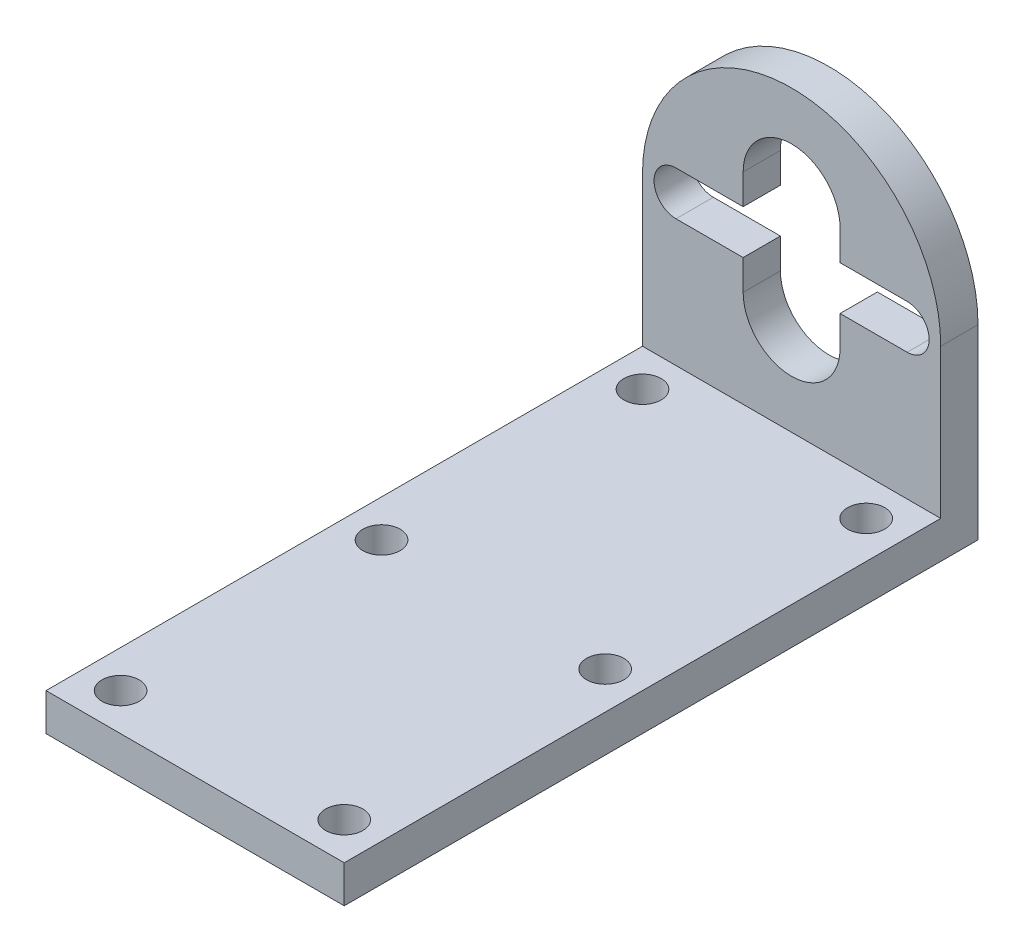
ISO-10303-21;
HEADER;
FILE_DESCRIPTION(('STEP AP214'),'2;1');
FILE_NAME('part.step','',(''),(''),'','','');
FILE_SCHEMA(('AUTOMOTIVE_DESIGN { 1 0 10303 214 1 1 1 1 }'));
ENDSEC;
DATA;
#1=APPLICATION_CONTEXT('core data for automotive mechanical design processes');
#2=APPLICATION_PROTOCOL_DEFINITION('international standard','automotive_design',2000,#1);
#3=PRODUCT_CONTEXT('',#1,'mechanical');
#4=PRODUCT('Part','Part','',(#3));
#5=PRODUCT_RELATED_PRODUCT_CATEGORY('part','',(#4));
#6=PRODUCT_DEFINITION_FORMATION('','',#4);
#7=PRODUCT_DEFINITION_CONTEXT('part definition',#1,'design');
#8=PRODUCT_DEFINITION('design','',#6,#7);
#9=PRODUCT_DEFINITION_SHAPE('','',#8);
#10=(LENGTH_UNIT() NAMED_UNIT(*) SI_UNIT(.MILLI.,.METRE.));
#11=(NAMED_UNIT(*) PLANE_ANGLE_UNIT() SI_UNIT($,.RADIAN.));
#12=(NAMED_UNIT(*) SI_UNIT($,.STERADIAN.) SOLID_ANGLE_UNIT());
#13=UNCERTAINTY_MEASURE_WITH_UNIT(LENGTH_MEASURE(1.E-05),#10,'distance_accuracy_value','');
#14=(GEOMETRIC_REPRESENTATION_CONTEXT(3) GLOBAL_UNCERTAINTY_ASSIGNED_CONTEXT((#13)) GLOBAL_UNIT_ASSIGNED_CONTEXT((#10,
#11,#12)) REPRESENTATION_CONTEXT('',''));
#15=CARTESIAN_POINT('',(0.,0.,0.));
#16=DIRECTION('',(0.,0.,1.));
#17=DIRECTION('',(1.,0.,0.));
#18=AXIS2_PLACEMENT_3D('',#15,#16,#17);
#19=CARTESIAN_POINT('',(-15.5,-2.95,5.));
#20=DIRECTION('',(0.,1.,0.));
#21=DIRECTION('',(-1.,0.,0.));
#22=AXIS2_PLACEMENT_3D('',#19,#20,#21);
#23=PLANE('',#22);
#24=DIRECTION('',(0.,0.,-1.));
#25=VECTOR('',#24,1.);
#26=CARTESIAN_POINT('',(6.5,-2.95,5.));
#27=LINE('',#26,#25);
#28=CARTESIAN_POINT('',(6.5,-2.95,5.));
#29=VERTEX_POINT('',#28);
#30=CARTESIAN_POINT('',(6.5,-2.95,0.));
#31=VERTEX_POINT('',#30);
#32=EDGE_CURVE('E209',#29,#31,#27,.T.);
#33=ORIENTED_EDGE('',*,*,#32,.F.);
#34=DIRECTION('',(1.,0.,0.));
#35=VECTOR('',#34,1.);
#36=CARTESIAN_POINT('',(-15.5,-2.95,5.));
#37=LINE('',#36,#35);
#38=CARTESIAN_POINT('',(15.5,-2.94999999999999,5.));
#39=VERTEX_POINT('',#38);
#40=EDGE_CURVE('E271',#29,#39,#37,.T.);
#41=ORIENTED_EDGE('',*,*,#40,.T.);
#42=DIRECTION('',(0.,0.,-1.));
#43=VECTOR('',#42,1.);
#44=CARTESIAN_POINT('',(15.5,-2.94999999999999,5.));
#45=LINE('',#44,#43);
#46=CARTESIAN_POINT('',(15.5,-2.94999999999999,0.));
#47=VERTEX_POINT('',#46);
#48=EDGE_CURVE('E299',#39,#47,#45,.T.);
#49=ORIENTED_EDGE('',*,*,#48,.T.);
#50=DIRECTION('',(1.,0.,0.));
#51=VECTOR('',#50,1.);
#52=CARTESIAN_POINT('',(-15.5,-2.95,0.));
#53=LINE('',#52,#51);
#54=EDGE_CURVE('E285',#31,#47,#53,.T.);
#55=ORIENTED_EDGE('',*,*,#54,.F.);
#56=EDGE_LOOP('',(#33,#41,#49,#55));
#57=FACE_BOUND('',#56,.T.);
#58=ADVANCED_FACE('F43',(#57),#23,.T.);
#59=CARTESIAN_POINT('',(-15.5,2.95,5.));
#60=DIRECTION('',(0.,-1.,0.));
#61=DIRECTION('',(1.,0.,0.));
#62=AXIS2_PLACEMENT_3D('',#59,#60,#61);
#63=PLANE('',#62);
#64=DIRECTION('',(0.,0.,1.));
#65=VECTOR('',#64,1.);
#66=CARTESIAN_POINT('',(6.5,2.95,5.));
#67=LINE('',#66,#65);
#68=CARTESIAN_POINT('',(6.5,2.95,0.));
#69=VERTEX_POINT('',#68);
#70=CARTESIAN_POINT('',(6.5,2.95,5.));
#71=VERTEX_POINT('',#70);
#72=EDGE_CURVE('E335',#69,#71,#67,.T.);
#73=ORIENTED_EDGE('',*,*,#72,.F.);
#74=DIRECTION('',(-1.,0.,0.));
#75=VECTOR('',#74,1.);
#76=CARTESIAN_POINT('',(-15.5,2.95,0.));
#77=LINE('',#76,#75);
#78=CARTESIAN_POINT('',(15.5,2.95000000000001,0.));
#79=VERTEX_POINT('',#78);
#80=EDGE_CURVE('E272',#79,#69,#77,.T.);
#81=ORIENTED_EDGE('',*,*,#80,.F.);
#82=DIRECTION('',(0.,0.,-1.));
#83=VECTOR('',#82,1.);
#84=CARTESIAN_POINT('',(15.5,2.95000000000001,5.));
#85=LINE('',#84,#83);
#86=CARTESIAN_POINT('',(15.5,2.95000000000001,5.));
#87=VERTEX_POINT('',#86);
#88=EDGE_CURVE('E297',#87,#79,#85,.T.);
#89=ORIENTED_EDGE('',*,*,#88,.F.);
#90=DIRECTION('',(-1.,0.,0.));
#91=VECTOR('',#90,1.);
#92=CARTESIAN_POINT('',(-15.5,2.95,5.));
#93=LINE('',#92,#91);
#94=EDGE_CURVE('E279',#87,#71,#93,.T.);
#95=ORIENTED_EDGE('',*,*,#94,.T.);
#96=EDGE_LOOP('',(#73,#81,#89,#95));
#97=FACE_BOUND('',#96,.T.);
#98=ADVANCED_FACE('F363',(#97),#63,.T.);
#99=CARTESIAN_POINT('',(0.,0.,5.));
#100=DIRECTION('',(0.,0.,1.));
#101=DIRECTION('',(1.,0.,0.));
#102=AXIS2_PLACEMENT_3D('',#99,#100,#101);
#103=PLANE('',#102);
#104=DIRECTION('',(0.,1.,0.));
#105=VECTOR('',#104,1.);
#106=CARTESIAN_POINT('',(6.5,7.,5.));
#107=LINE('',#106,#105);
#108=CARTESIAN_POINT('',(6.5,7.,5.));
#109=VERTEX_POINT('',#108);
#110=EDGE_CURVE('E194',#71,#109,#107,.T.);
#111=ORIENTED_EDGE('',*,*,#110,.F.);
#112=ORIENTED_EDGE('',*,*,#94,.F.);
#113=CARTESIAN_POINT('',(15.5,0.,5.));
#114=DIRECTION('',(0.,0.,1.));
#115=DIRECTION('',(1.,0.,0.));
#116=AXIS2_PLACEMENT_3D('',#113,#114,#115);
#117=CIRCLE('',#116,2.95);
#118=EDGE_CURVE('E276',#39,#87,#117,.T.);
#119=ORIENTED_EDGE('',*,*,#118,.F.);
#120=ORIENTED_EDGE('',*,*,#40,.F.);
#121=CARTESIAN_POINT('',(6.5,-7.,5.));
#122=VERTEX_POINT('',#121);
#123=EDGE_CURVE('E174',#122,#29,#107,.T.);
#124=ORIENTED_EDGE('',*,*,#123,.F.);
#125=CARTESIAN_POINT('',(0.,-7.,5.));
#126=DIRECTION('',(0.,0.,1.));
#127=DIRECTION('',(1.,0.,0.));
#128=AXIS2_PLACEMENT_3D('',#125,#126,#127);
#129=CIRCLE('',#128,6.5);
#130=CARTESIAN_POINT('',(-6.5,-7.,5.));
#131=VERTEX_POINT('',#130);
#132=EDGE_CURVE('E191',#131,#122,#129,.T.);
#133=ORIENTED_EDGE('',*,*,#132,.F.);
#134=DIRECTION('',(0.,-1.,0.));
#135=VECTOR('',#134,1.);
#136=CARTESIAN_POINT('',(-6.5,7.,5.));
#137=LINE('',#136,#135);
#138=CARTESIAN_POINT('',(-6.5,-2.94999999999999,5.));
#139=VERTEX_POINT('',#138);
#140=EDGE_CURVE('E184',#139,#131,#137,.T.);
#141=ORIENTED_EDGE('',*,*,#140,.F.);
#142=CARTESIAN_POINT('',(-15.5,-2.95,5.));
#143=VERTEX_POINT('',#142);
#144=EDGE_CURVE('E273',#143,#139,#37,.T.);
#145=ORIENTED_EDGE('',*,*,#144,.F.);
#146=CARTESIAN_POINT('',(-15.5,0.,5.));
#147=DIRECTION('',(0.,0.,1.));
#148=DIRECTION('',(1.,0.,0.));
#149=AXIS2_PLACEMENT_3D('',#146,#147,#148);
#150=CIRCLE('',#149,2.95);
#151=CARTESIAN_POINT('',(-15.5,2.95,5.));
#152=VERTEX_POINT('',#151);
#153=EDGE_CURVE('E269',#152,#143,#150,.T.);
#154=ORIENTED_EDGE('',*,*,#153,.F.);
#155=CARTESIAN_POINT('',(-6.5,2.95,5.));
#156=VERTEX_POINT('',#155);
#157=EDGE_CURVE('E190',#156,#152,#93,.T.);
#158=ORIENTED_EDGE('',*,*,#157,.F.);
#159=CARTESIAN_POINT('',(-6.5,7.,5.));
#160=VERTEX_POINT('',#159);
#161=EDGE_CURVE('E66',#160,#156,#137,.T.);
#162=ORIENTED_EDGE('',*,*,#161,.F.);
#163=CARTESIAN_POINT('',(0.,7.,5.));
#164=DIRECTION('',(0.,0.,1.));
#165=DIRECTION('',(1.,0.,0.));
#166=AXIS2_PLACEMENT_3D('',#163,#164,#165);
#167=CIRCLE('',#166,6.5);
#168=EDGE_CURVE('E177',#109,#160,#167,.T.);
#169=ORIENTED_EDGE('',*,*,#168,.F.);
#170=EDGE_LOOP('',(#111,#112,#119,#120,#124,#133,#141,#145,#154,#158,#162,#169));
#171=FACE_BOUND('',#170,.T.);
#172=DIRECTION('',(-1.,0.,0.));
#173=VECTOR('',#172,1.);
#174=CARTESIAN_POINT('',(20.,-20.,5.));
#175=LINE('',#174,#173);
#176=CARTESIAN_POINT('',(20.,-20.,5.));
#177=VERTEX_POINT('',#176);
#178=CARTESIAN_POINT('',(-20.,-20.,5.));
#179=VERTEX_POINT('',#178);
#180=EDGE_CURVE('E248',#177,#179,#175,.T.);
#181=ORIENTED_EDGE('',*,*,#180,.F.);
#182=DIRECTION('',(0.,1.,0.));
#183=VECTOR('',#182,1.);
#184=CARTESIAN_POINT('',(20.,0.,5.));
#185=LINE('',#184,#183);
#186=CARTESIAN_POINT('',(20.,0.,5.));
#187=VERTEX_POINT('',#186);
#188=EDGE_CURVE('E312',#177,#187,#185,.T.);
#189=ORIENTED_EDGE('',*,*,#188,.T.);
#190=CARTESIAN_POINT('',(0.,0.,5.));
#191=DIRECTION('',(0.,0.,1.));
#192=DIRECTION('',(1.,0.,0.));
#193=AXIS2_PLACEMENT_3D('',#190,#191,#192);
#194=CIRCLE('',#193,20.);
#195=CARTESIAN_POINT('',(-20.,0.,5.));
#196=VERTEX_POINT('',#195);
#197=EDGE_CURVE('E306',#187,#196,#194,.T.);
#198=ORIENTED_EDGE('',*,*,#197,.T.);
#199=DIRECTION('',(0.,-1.,0.));
#200=VECTOR('',#199,1.);
#201=CARTESIAN_POINT('',(-20.,-25.,5.));
#202=LINE('',#201,#200);
#203=EDGE_CURVE('E309',#196,#179,#202,.T.);
#204=ORIENTED_EDGE('',*,*,#203,.T.);
#205=EDGE_LOOP('',(#181,#189,#198,#204));
#206=FACE_BOUND('',#205,.T.);
#207=ADVANCED_FACE('F187',(#171,#206),#103,.T.);
#208=CARTESIAN_POINT('',(0.,0.,0.));
#209=DIRECTION('',(0.,0.,1.));
#210=DIRECTION('',(1.,0.,0.));
#211=AXIS2_PLACEMENT_3D('',#208,#209,#210);
#212=PLANE('',#211);
#213=CARTESIAN_POINT('',(0.,0.,0.));
#214=DIRECTION('',(0.,0.,1.));
#215=DIRECTION('',(1.,0.,0.));
#216=AXIS2_PLACEMENT_3D('',#213,#214,#215);
#217=CIRCLE('',#216,20.);
#218=CARTESIAN_POINT('',(20.,0.,0.));
#219=VERTEX_POINT('',#218);
#220=CARTESIAN_POINT('',(-20.,0.,0.));
#221=VERTEX_POINT('',#220);
#222=EDGE_CURVE('E305',#219,#221,#217,.T.);
#223=ORIENTED_EDGE('',*,*,#222,.F.);
#224=DIRECTION('',(0.,1.,0.));
#225=VECTOR('',#224,1.);
#226=CARTESIAN_POINT('',(20.,0.,0.));
#227=LINE('',#226,#225);
#228=CARTESIAN_POINT('',(20.,-25.,0.));
#229=VERTEX_POINT('',#228);
#230=EDGE_CURVE('E310',#229,#219,#227,.T.);
#231=ORIENTED_EDGE('',*,*,#230,.F.);
#232=DIRECTION('',(1.,0.,0.));
#233=VECTOR('',#232,1.);
#234=CARTESIAN_POINT('',(20.,-25.,0.));
#235=LINE('',#234,#233);
#236=CARTESIAN_POINT('',(-20.,-25.,0.));
#237=VERTEX_POINT('',#236);
#238=EDGE_CURVE('E319',#237,#229,#235,.T.);
#239=ORIENTED_EDGE('',*,*,#238,.F.);
#240=DIRECTION('',(0.,-1.,0.));
#241=VECTOR('',#240,1.);
#242=CARTESIAN_POINT('',(-20.,-25.,0.));
#243=LINE('',#242,#241);
#244=EDGE_CURVE('E317',#221,#237,#243,.T.);
#245=ORIENTED_EDGE('',*,*,#244,.F.);
#246=EDGE_LOOP('',(#223,#231,#239,#245));
#247=FACE_BOUND('',#246,.T.);
#248=ORIENTED_EDGE('',*,*,#80,.T.);
#249=DIRECTION('',(0.,1.,0.));
#250=VECTOR('',#249,1.);
#251=CARTESIAN_POINT('',(6.5,0.,0.));
#252=LINE('',#251,#250);
#253=CARTESIAN_POINT('',(6.5,7.,0.));
#254=VERTEX_POINT('',#253);
#255=EDGE_CURVE('E206',#69,#254,#252,.T.);
#256=ORIENTED_EDGE('',*,*,#255,.T.);
#257=CARTESIAN_POINT('',(0.,7.,0.));
#258=DIRECTION('',(0.,0.,1.));
#259=DIRECTION('',(1.,0.,0.));
#260=AXIS2_PLACEMENT_3D('',#257,#258,#259);
#261=CIRCLE('',#260,6.5);
#262=CARTESIAN_POINT('',(-6.5,7.,0.));
#263=VERTEX_POINT('',#262);
#264=EDGE_CURVE('E11',#254,#263,#261,.T.);
#265=ORIENTED_EDGE('',*,*,#264,.T.);
#266=DIRECTION('',(0.,-1.,0.));
#267=VECTOR('',#266,1.);
#268=CARTESIAN_POINT('',(-6.5,0.,0.));
#269=LINE('',#268,#267);
#270=CARTESIAN_POINT('',(-6.5,2.95,0.));
#271=VERTEX_POINT('',#270);
#272=EDGE_CURVE('E171',#263,#271,#269,.T.);
#273=ORIENTED_EDGE('',*,*,#272,.T.);
#274=CARTESIAN_POINT('',(-15.5,2.95,0.));
#275=VERTEX_POINT('',#274);
#276=EDGE_CURVE('E292',#271,#275,#77,.T.);
#277=ORIENTED_EDGE('',*,*,#276,.T.);
#278=CARTESIAN_POINT('',(-15.5,0.,0.));
#279=DIRECTION('',(0.,0.,1.));
#280=DIRECTION('',(1.,0.,0.));
#281=AXIS2_PLACEMENT_3D('',#278,#279,#280);
#282=CIRCLE('',#281,2.95);
#283=CARTESIAN_POINT('',(-15.5,-2.95,0.));
#284=VERTEX_POINT('',#283);
#285=EDGE_CURVE('E268',#275,#284,#282,.T.);
#286=ORIENTED_EDGE('',*,*,#285,.T.);
#287=CARTESIAN_POINT('',(-6.5,-2.95,0.));
#288=VERTEX_POINT('',#287);
#289=EDGE_CURVE('E286',#284,#288,#53,.T.);
#290=ORIENTED_EDGE('',*,*,#289,.T.);
#291=CARTESIAN_POINT('',(-6.5,-7.,0.));
#292=VERTEX_POINT('',#291);
#293=EDGE_CURVE('E58',#288,#292,#269,.T.);
#294=ORIENTED_EDGE('',*,*,#293,.T.);
#295=CARTESIAN_POINT('',(0.,-7.,0.));
#296=DIRECTION('',(0.,0.,1.));
#297=DIRECTION('',(1.,0.,0.));
#298=AXIS2_PLACEMENT_3D('',#295,#296,#297);
#299=CIRCLE('',#298,6.5);
#300=CARTESIAN_POINT('',(6.5,-7.,0.));
#301=VERTEX_POINT('',#300);
#302=EDGE_CURVE('E51',#292,#301,#299,.T.);
#303=ORIENTED_EDGE('',*,*,#302,.T.);
#304=EDGE_CURVE('E210',#301,#31,#252,.T.);
#305=ORIENTED_EDGE('',*,*,#304,.T.);
#306=ORIENTED_EDGE('',*,*,#54,.T.);
#307=CARTESIAN_POINT('',(15.5,0.,0.));
#308=DIRECTION('',(0.,0.,1.));
#309=DIRECTION('',(1.,0.,0.));
#310=AXIS2_PLACEMENT_3D('',#307,#308,#309);
#311=CIRCLE('',#310,2.95);
#312=EDGE_CURVE('E289',#47,#79,#311,.T.);
#313=ORIENTED_EDGE('',*,*,#312,.T.);
#314=EDGE_LOOP('',(#248,#256,#265,#273,#277,#286,#290,#294,#303,#305,#306,#313));
#315=FACE_BOUND('',#314,.T.);
#316=ADVANCED_FACE('F339',(#247,#315),#212,.F.);
#317=CARTESIAN_POINT('',(0.,0.,5.));
#318=DIRECTION('',(0.,0.,-1.));
#319=DIRECTION('',(-1.,0.,0.));
#320=AXIS2_PLACEMENT_3D('',#317,#318,#319);
#321=CYLINDRICAL_SURFACE('',#320,20.);
#322=ORIENTED_EDGE('',*,*,#222,.T.);
#323=DIRECTION('',(0.,0.,-1.));
#324=VECTOR('',#323,1.);
#325=CARTESIAN_POINT('',(-20.,0.,5.));
#326=LINE('',#325,#324);
#327=EDGE_CURVE('E330',#196,#221,#326,.T.);
#328=ORIENTED_EDGE('',*,*,#327,.F.);
#329=ORIENTED_EDGE('',*,*,#197,.F.);
#330=DIRECTION('',(0.,0.,-1.));
#331=VECTOR('',#330,1.);
#332=CARTESIAN_POINT('',(20.,0.,5.));
#333=LINE('',#332,#331);
#334=EDGE_CURVE('E314',#187,#219,#333,.T.);
#335=ORIENTED_EDGE('',*,*,#334,.T.);
#336=EDGE_LOOP('',(#322,#328,#329,#335));
#337=FACE_BOUND('',#336,.T.);
#338=ADVANCED_FACE('F45',(#337),#321,.T.);
#339=CARTESIAN_POINT('',(-20.,-25.,5.));
#340=DIRECTION('',(1.,0.,0.));
#341=DIRECTION('',(0.,1.,0.));
#342=AXIS2_PLACEMENT_3D('',#339,#340,#341);
#343=PLANE('',#342);
#344=ORIENTED_EDGE('',*,*,#244,.T.);
#345=DIRECTION('',(0.,0.,-1.));
#346=VECTOR('',#345,1.);
#347=CARTESIAN_POINT('',(-20.,-25.,5.));
#348=LINE('',#347,#346);
#349=CARTESIAN_POINT('',(-20.,-25.,85.));
#350=VERTEX_POINT('',#349);
#351=EDGE_CURVE('E327',#350,#237,#348,.T.);
#352=ORIENTED_EDGE('',*,*,#351,.F.);
#353=DIRECTION('',(0.,-1.,0.));
#354=VECTOR('',#353,1.);
#355=CARTESIAN_POINT('',(-20.,-20.,85.));
#356=LINE('',#355,#354);
#357=CARTESIAN_POINT('',(-20.,-20.,85.));
#358=VERTEX_POINT('',#357);
#359=EDGE_CURVE('E254',#358,#350,#356,.T.);
#360=ORIENTED_EDGE('',*,*,#359,.F.);
#361=DIRECTION('',(0.,0.,-1.));
#362=VECTOR('',#361,1.);
#363=CARTESIAN_POINT('',(-20.,-20.,85.));
#364=LINE('',#363,#362);
#365=EDGE_CURVE('E260',#358,#179,#364,.T.);
#366=ORIENTED_EDGE('',*,*,#365,.T.);
#367=ORIENTED_EDGE('',*,*,#203,.F.);
#368=ORIENTED_EDGE('',*,*,#327,.T.);
#369=EDGE_LOOP('',(#344,#352,#360,#366,#367,#368));
#370=FACE_BOUND('',#369,.T.);
#371=ADVANCED_FACE('F555',(#370),#343,.F.);
#372=CARTESIAN_POINT('',(20.,-25.,5.));
#373=DIRECTION('',(0.,1.,0.));
#374=DIRECTION('',(0.,0.,1.));
#375=AXIS2_PLACEMENT_3D('',#372,#373,#374);
#376=PLANE('',#375);
#377=CARTESIAN_POINT('',(15.,-25.,10.));
#378=DIRECTION('',(0.,1.,0.));
#379=DIRECTION('',(0.,0.,1.));
#380=AXIS2_PLACEMENT_3D('',#377,#378,#379);
#381=CIRCLE('',#380,2.5);
#382=CARTESIAN_POINT('',(15.,-25.,12.5));
#383=VERTEX_POINT('',#382);
#384=EDGE_CURVE('E245',#383,#383,#381,.T.);
#385=ORIENTED_EDGE('',*,*,#384,.T.);
#386=EDGE_LOOP('',(#385));
#387=FACE_BOUND('',#386,.T.);
#388=CARTESIAN_POINT('',(15.,-25.,80.));
#389=DIRECTION('',(0.,1.,0.));
#390=DIRECTION('',(0.,0.,1.));
#391=AXIS2_PLACEMENT_3D('',#388,#389,#390);
#392=CIRCLE('',#391,2.5);
#393=CARTESIAN_POINT('',(15.,-25.,82.5));
#394=VERTEX_POINT('',#393);
#395=EDGE_CURVE('E242',#394,#394,#392,.T.);
#396=ORIENTED_EDGE('',*,*,#395,.T.);
#397=EDGE_LOOP('',(#396));
#398=FACE_BOUND('',#397,.T.);
#399=CARTESIAN_POINT('',(-15.,-25.,80.));
#400=DIRECTION('',(0.,1.,0.));
#401=DIRECTION('',(0.,0.,1.));
#402=AXIS2_PLACEMENT_3D('',#399,#400,#401);
#403=CIRCLE('',#402,2.5);
#404=CARTESIAN_POINT('',(-15.,-25.,82.5));
#405=VERTEX_POINT('',#404);
#406=EDGE_CURVE('E239',#405,#405,#403,.T.);
#407=ORIENTED_EDGE('',*,*,#406,.T.);
#408=EDGE_LOOP('',(#407));
#409=FACE_BOUND('',#408,.T.);
#410=CARTESIAN_POINT('',(-15.,-25.,45.));
#411=DIRECTION('',(0.,1.,0.));
#412=DIRECTION('',(0.,0.,1.));
#413=AXIS2_PLACEMENT_3D('',#410,#411,#412);
#414=CIRCLE('',#413,2.5);
#415=CARTESIAN_POINT('',(-15.,-25.,47.5));
#416=VERTEX_POINT('',#415);
#417=EDGE_CURVE('E236',#416,#416,#414,.T.);
#418=ORIENTED_EDGE('',*,*,#417,.T.);
#419=EDGE_LOOP('',(#418));
#420=FACE_BOUND('',#419,.T.);
#421=CARTESIAN_POINT('',(15.,-25.,45.));
#422=DIRECTION('',(0.,1.,0.));
#423=DIRECTION('',(0.,0.,1.));
#424=AXIS2_PLACEMENT_3D('',#421,#422,#423);
#425=CIRCLE('',#424,2.5);
#426=CARTESIAN_POINT('',(15.,-25.,47.5));
#427=VERTEX_POINT('',#426);
#428=EDGE_CURVE('E233',#427,#427,#425,.T.);
#429=ORIENTED_EDGE('',*,*,#428,.T.);
#430=EDGE_LOOP('',(#429));
#431=FACE_BOUND('',#430,.T.);
#432=CARTESIAN_POINT('',(-15.,-25.,10.));
#433=DIRECTION('',(0.,1.,0.));
#434=DIRECTION('',(0.,0.,1.));
#435=AXIS2_PLACEMENT_3D('',#432,#433,#434);
#436=CIRCLE('',#435,2.5);
#437=CARTESIAN_POINT('',(-15.,-25.,12.5));
#438=VERTEX_POINT('',#437);
#439=EDGE_CURVE('E230',#438,#438,#436,.T.);
#440=ORIENTED_EDGE('',*,*,#439,.T.);
#441=EDGE_LOOP('',(#440));
#442=FACE_BOUND('',#441,.T.);
#443=ORIENTED_EDGE('',*,*,#238,.T.);
#444=DIRECTION('',(0.,0.,-1.));
#445=VECTOR('',#444,1.);
#446=CARTESIAN_POINT('',(20.,-25.,5.));
#447=LINE('',#446,#445);
#448=CARTESIAN_POINT('',(20.,-25.,85.));
#449=VERTEX_POINT('',#448);
#450=EDGE_CURVE('E324',#449,#229,#447,.T.);
#451=ORIENTED_EDGE('',*,*,#450,.F.);
#452=DIRECTION('',(1.,0.,0.));
#453=VECTOR('',#452,1.);
#454=CARTESIAN_POINT('',(20.,-25.,85.));
#455=LINE('',#454,#453);
#456=EDGE_CURVE('E257',#350,#449,#455,.T.);
#457=ORIENTED_EDGE('',*,*,#456,.F.);
#458=ORIENTED_EDGE('',*,*,#351,.T.);
#459=EDGE_LOOP('',(#443,#451,#457,#458));
#460=FACE_BOUND('',#459,.T.);
#461=ADVANCED_FACE('F542',(#387,#398,#409,#420,#431,#442,#460),#376,.F.);
#462=CARTESIAN_POINT('',(20.,0.,5.));
#463=DIRECTION('',(-1.,0.,0.));
#464=DIRECTION('',(0.,-1.,0.));
#465=AXIS2_PLACEMENT_3D('',#462,#463,#464);
#466=PLANE('',#465);
#467=ORIENTED_EDGE('',*,*,#230,.T.);
#468=ORIENTED_EDGE('',*,*,#334,.F.);
#469=ORIENTED_EDGE('',*,*,#188,.F.);
#470=DIRECTION('',(0.,0.,-1.));
#471=VECTOR('',#470,1.);
#472=CARTESIAN_POINT('',(20.,-20.,85.));
#473=LINE('',#472,#471);
#474=CARTESIAN_POINT('',(20.,-20.,85.));
#475=VERTEX_POINT('',#474);
#476=EDGE_CURVE('E265',#475,#177,#473,.T.);
#477=ORIENTED_EDGE('',*,*,#476,.F.);
#478=DIRECTION('',(0.,1.,0.));
#479=VECTOR('',#478,1.);
#480=CARTESIAN_POINT('',(20.,-20.,85.));
#481=LINE('',#480,#479);
#482=EDGE_CURVE('E249',#449,#475,#481,.T.);
#483=ORIENTED_EDGE('',*,*,#482,.F.);
#484=ORIENTED_EDGE('',*,*,#450,.T.);
#485=EDGE_LOOP('',(#467,#468,#469,#477,#483,#484));
#486=FACE_BOUND('',#485,.T.);
#487=ADVANCED_FACE('F385',(#486),#466,.F.);
#488=CARTESIAN_POINT('',(-15.5,0.,5.));
#489=DIRECTION('',(0.,0.,-1.));
#490=DIRECTION('',(-1.,0.,0.));
#491=AXIS2_PLACEMENT_3D('',#488,#489,#490);
#492=CYLINDRICAL_SURFACE('',#491,2.95);
#493=ORIENTED_EDGE('',*,*,#285,.F.);
#494=DIRECTION('',(0.,0.,-1.));
#495=VECTOR('',#494,1.);
#496=CARTESIAN_POINT('',(-15.5,2.95,5.));
#497=LINE('',#496,#495);
#498=EDGE_CURVE('E282',#152,#275,#497,.T.);
#499=ORIENTED_EDGE('',*,*,#498,.F.);
#500=ORIENTED_EDGE('',*,*,#153,.T.);
#501=DIRECTION('',(0.,0.,-1.));
#502=VECTOR('',#501,1.);
#503=CARTESIAN_POINT('',(-15.5,-2.95,5.));
#504=LINE('',#503,#502);
#505=EDGE_CURVE('E302',#143,#284,#504,.T.);
#506=ORIENTED_EDGE('',*,*,#505,.T.);
#507=EDGE_LOOP('',(#493,#499,#500,#506));
#508=FACE_BOUND('',#507,.T.);
#509=ADVANCED_FACE('F372',(#508),#492,.F.);
#510=DIRECTION('',(0.,0.,1.));
#511=VECTOR('',#510,1.);
#512=CARTESIAN_POINT('',(-6.5,-2.95,5.));
#513=LINE('',#512,#511);
#514=EDGE_CURVE('E204',#288,#139,#513,.T.);
#515=ORIENTED_EDGE('',*,*,#514,.F.);
#516=ORIENTED_EDGE('',*,*,#289,.F.);
#517=ORIENTED_EDGE('',*,*,#505,.F.);
#518=ORIENTED_EDGE('',*,*,#144,.T.);
#519=EDGE_LOOP('',(#515,#516,#517,#518));
#520=FACE_BOUND('',#519,.T.);
#521=ADVANCED_FACE('F375',(#520),#23,.T.);
#522=CARTESIAN_POINT('',(15.5,0.,5.));
#523=DIRECTION('',(0.,0.,-1.));
#524=DIRECTION('',(-1.,0.,0.));
#525=AXIS2_PLACEMENT_3D('',#522,#523,#524);
#526=CYLINDRICAL_SURFACE('',#525,2.95);
#527=ORIENTED_EDGE('',*,*,#312,.F.);
#528=ORIENTED_EDGE('',*,*,#48,.F.);
#529=ORIENTED_EDGE('',*,*,#118,.T.);
#530=ORIENTED_EDGE('',*,*,#88,.T.);
#531=EDGE_LOOP('',(#527,#528,#529,#530));
#532=FACE_BOUND('',#531,.T.);
#533=ADVANCED_FACE('F359',(#532),#526,.F.);
#534=DIRECTION('',(0.,0.,-1.));
#535=VECTOR('',#534,1.);
#536=CARTESIAN_POINT('',(-6.5,2.95,5.));
#537=LINE('',#536,#535);
#538=EDGE_CURVE('E333',#156,#271,#537,.T.);
#539=ORIENTED_EDGE('',*,*,#538,.F.);
#540=ORIENTED_EDGE('',*,*,#157,.T.);
#541=ORIENTED_EDGE('',*,*,#498,.T.);
#542=ORIENTED_EDGE('',*,*,#276,.F.);
#543=EDGE_LOOP('',(#539,#540,#541,#542));
#544=FACE_BOUND('',#543,.T.);
#545=ADVANCED_FACE('F369',(#544),#63,.T.);
#546=CARTESIAN_POINT('',(20.,-20.,85.));
#547=DIRECTION('',(0.,-1.,0.));
#548=DIRECTION('',(1.,0.,0.));
#549=AXIS2_PLACEMENT_3D('',#546,#547,#548);
#550=PLANE('',#549);
#551=CARTESIAN_POINT('',(15.,-20.,10.));
#552=DIRECTION('',(0.,1.,0.));
#553=DIRECTION('',(-1.,0.,0.));
#554=AXIS2_PLACEMENT_3D('',#551,#552,#553);
#555=CIRCLE('',#554,2.5);
#556=CARTESIAN_POINT('',(12.5,-20.,10.));
#557=VERTEX_POINT('',#556);
#558=EDGE_CURVE('E216',#557,#557,#555,.T.);
#559=ORIENTED_EDGE('',*,*,#558,.F.);
#560=EDGE_LOOP('',(#559));
#561=FACE_BOUND('',#560,.T.);
#562=CARTESIAN_POINT('',(15.,-20.,80.));
#563=DIRECTION('',(0.,1.,0.));
#564=DIRECTION('',(-1.,0.,0.));
#565=AXIS2_PLACEMENT_3D('',#562,#563,#564);
#566=CIRCLE('',#565,2.5);
#567=CARTESIAN_POINT('',(12.5,-20.,80.));
#568=VERTEX_POINT('',#567);
#569=EDGE_CURVE('E220',#568,#568,#566,.T.);
#570=ORIENTED_EDGE('',*,*,#569,.F.);
#571=EDGE_LOOP('',(#570));
#572=FACE_BOUND('',#571,.T.);
#573=CARTESIAN_POINT('',(-15.,-20.,80.));
#574=DIRECTION('',(0.,1.,0.));
#575=DIRECTION('',(-1.,0.,0.));
#576=AXIS2_PLACEMENT_3D('',#573,#574,#575);
#577=CIRCLE('',#576,2.5);
#578=CARTESIAN_POINT('',(-17.5,-20.,80.));
#579=VERTEX_POINT('',#578);
#580=EDGE_CURVE('E223',#579,#579,#577,.T.);
#581=ORIENTED_EDGE('',*,*,#580,.F.);
#582=EDGE_LOOP('',(#581));
#583=FACE_BOUND('',#582,.T.);
#584=CARTESIAN_POINT('',(-15.,-20.,45.));
#585=DIRECTION('',(0.,1.,0.));
#586=DIRECTION('',(-1.,0.,0.));
#587=AXIS2_PLACEMENT_3D('',#584,#585,#586);
#588=CIRCLE('',#587,2.5);
#589=CARTESIAN_POINT('',(-17.5,-20.,45.));
#590=VERTEX_POINT('',#589);
#591=EDGE_CURVE('E215',#590,#590,#588,.T.);
#592=ORIENTED_EDGE('',*,*,#591,.F.);
#593=EDGE_LOOP('',(#592));
#594=FACE_BOUND('',#593,.T.);
#595=CARTESIAN_POINT('',(15.,-20.,45.));
#596=DIRECTION('',(0.,1.,0.));
#597=DIRECTION('',(-1.,0.,0.));
#598=AXIS2_PLACEMENT_3D('',#595,#596,#597);
#599=CIRCLE('',#598,2.5);
#600=CARTESIAN_POINT('',(12.5,-20.,45.));
#601=VERTEX_POINT('',#600);
#602=EDGE_CURVE('E212',#601,#601,#599,.T.);
#603=ORIENTED_EDGE('',*,*,#602,.F.);
#604=EDGE_LOOP('',(#603));
#605=FACE_BOUND('',#604,.T.);
#606=CARTESIAN_POINT('',(-15.,-20.,10.));
#607=DIRECTION('',(0.,1.,0.));
#608=DIRECTION('',(-1.,0.,0.));
#609=AXIS2_PLACEMENT_3D('',#606,#607,#608);
#610=CIRCLE('',#609,2.5);
#611=CARTESIAN_POINT('',(-17.5,-20.,10.));
#612=VERTEX_POINT('',#611);
#613=EDGE_CURVE('E219',#612,#612,#610,.T.);
#614=ORIENTED_EDGE('',*,*,#613,.F.);
#615=EDGE_LOOP('',(#614));
#616=FACE_BOUND('',#615,.T.);
#617=ORIENTED_EDGE('',*,*,#180,.T.);
#618=ORIENTED_EDGE('',*,*,#365,.F.);
#619=DIRECTION('',(-1.,0.,0.));
#620=VECTOR('',#619,1.);
#621=CARTESIAN_POINT('',(20.,-20.,85.));
#622=LINE('',#621,#620);
#623=EDGE_CURVE('E252',#475,#358,#622,.T.);
#624=ORIENTED_EDGE('',*,*,#623,.F.);
#625=ORIENTED_EDGE('',*,*,#476,.T.);
#626=EDGE_LOOP('',(#617,#618,#624,#625));
#627=FACE_BOUND('',#626,.T.);
#628=ADVANCED_FACE('F398',(#561,#572,#583,#594,#605,#616,#627),#550,.F.);
#629=CARTESIAN_POINT('',(0.,0.,85.));
#630=DIRECTION('',(0.,0.,-1.));
#631=DIRECTION('',(-1.,0.,0.));
#632=AXIS2_PLACEMENT_3D('',#629,#630,#631);
#633=PLANE('',#632);
#634=ORIENTED_EDGE('',*,*,#482,.T.);
#635=ORIENTED_EDGE('',*,*,#623,.T.);
#636=ORIENTED_EDGE('',*,*,#359,.T.);
#637=ORIENTED_EDGE('',*,*,#456,.T.);
#638=EDGE_LOOP('',(#634,#635,#636,#637));
#639=FACE_BOUND('',#638,.T.);
#640=ADVANCED_FACE('F403',(#639),#633,.F.);
#641=CARTESIAN_POINT('',(-15.,-30.,10.));
#642=DIRECTION('',(0.,1.,0.));
#643=DIRECTION('',(-1.,0.,0.));
#644=AXIS2_PLACEMENT_3D('',#641,#642,#643);
#645=CYLINDRICAL_SURFACE('',#644,2.5);
#646=ORIENTED_EDGE('',*,*,#613,.T.);
#647=EDGE_LOOP('',(#646));
#648=FACE_BOUND('',#647,.T.);
#649=ORIENTED_EDGE('',*,*,#439,.F.);
#650=EDGE_LOOP('',(#649));
#651=FACE_BOUND('',#650,.T.);
#652=ADVANCED_FACE('F410',(#648,#651),#645,.F.);
#653=CARTESIAN_POINT('',(15.,-30.,45.));
#654=DIRECTION('',(0.,1.,0.));
#655=DIRECTION('',(-1.,0.,0.));
#656=AXIS2_PLACEMENT_3D('',#653,#654,#655);
#657=CYLINDRICAL_SURFACE('',#656,2.5);
#658=ORIENTED_EDGE('',*,*,#602,.T.);
#659=EDGE_LOOP('',(#658));
#660=FACE_BOUND('',#659,.T.);
#661=ORIENTED_EDGE('',*,*,#428,.F.);
#662=EDGE_LOOP('',(#661));
#663=FACE_BOUND('',#662,.T.);
#664=ADVANCED_FACE('F417',(#660,#663),#657,.F.);
#665=CARTESIAN_POINT('',(-15.,-30.,45.));
#666=DIRECTION('',(0.,1.,0.));
#667=DIRECTION('',(-1.,0.,0.));
#668=AXIS2_PLACEMENT_3D('',#665,#666,#667);
#669=CYLINDRICAL_SURFACE('',#668,2.5);
#670=ORIENTED_EDGE('',*,*,#591,.T.);
#671=EDGE_LOOP('',(#670));
#672=FACE_BOUND('',#671,.T.);
#673=ORIENTED_EDGE('',*,*,#417,.F.);
#674=EDGE_LOOP('',(#673));
#675=FACE_BOUND('',#674,.T.);
#676=ADVANCED_FACE('F419',(#672,#675),#669,.F.);
#677=CARTESIAN_POINT('',(-15.,-30.,80.));
#678=DIRECTION('',(0.,1.,0.));
#679=DIRECTION('',(-1.,0.,0.));
#680=AXIS2_PLACEMENT_3D('',#677,#678,#679);
#681=CYLINDRICAL_SURFACE('',#680,2.5);
#682=ORIENTED_EDGE('',*,*,#580,.T.);
#683=EDGE_LOOP('',(#682));
#684=FACE_BOUND('',#683,.T.);
#685=ORIENTED_EDGE('',*,*,#406,.F.);
#686=EDGE_LOOP('',(#685));
#687=FACE_BOUND('',#686,.T.);
#688=ADVANCED_FACE('F422',(#684,#687),#681,.F.);
#689=CARTESIAN_POINT('',(15.,-30.,80.));
#690=DIRECTION('',(0.,1.,0.));
#691=DIRECTION('',(-1.,0.,0.));
#692=AXIS2_PLACEMENT_3D('',#689,#690,#691);
#693=CYLINDRICAL_SURFACE('',#692,2.5);
#694=ORIENTED_EDGE('',*,*,#569,.T.);
#695=EDGE_LOOP('',(#694));
#696=FACE_BOUND('',#695,.T.);
#697=ORIENTED_EDGE('',*,*,#395,.F.);
#698=EDGE_LOOP('',(#697));
#699=FACE_BOUND('',#698,.T.);
#700=ADVANCED_FACE('F426',(#696,#699),#693,.F.);
#701=CARTESIAN_POINT('',(15.,-30.,10.));
#702=DIRECTION('',(0.,1.,0.));
#703=DIRECTION('',(-1.,0.,0.));
#704=AXIS2_PLACEMENT_3D('',#701,#702,#703);
#705=CYLINDRICAL_SURFACE('',#704,2.5);
#706=ORIENTED_EDGE('',*,*,#558,.T.);
#707=EDGE_LOOP('',(#706));
#708=FACE_BOUND('',#707,.T.);
#709=ORIENTED_EDGE('',*,*,#384,.F.);
#710=EDGE_LOOP('',(#709));
#711=FACE_BOUND('',#710,.T.);
#712=ADVANCED_FACE('F430',(#708,#711),#705,.F.);
#713=CARTESIAN_POINT('',(-6.5,7.,-5.));
#714=DIRECTION('',(-1.,0.,0.));
#715=DIRECTION('',(0.,-1.,0.));
#716=AXIS2_PLACEMENT_3D('',#713,#714,#715);
#717=PLANE('',#716);
#718=DIRECTION('',(0.,0.,1.));
#719=VECTOR('',#718,1.);
#720=CARTESIAN_POINT('',(-6.5,7.,-5.));
#721=LINE('',#720,#719);
#722=EDGE_CURVE('E167',#263,#160,#721,.T.);
#723=ORIENTED_EDGE('',*,*,#722,.T.);
#724=ORIENTED_EDGE('',*,*,#161,.T.);
#725=ORIENTED_EDGE('',*,*,#538,.T.);
#726=ORIENTED_EDGE('',*,*,#272,.F.);
#727=EDGE_LOOP('',(#723,#724,#725,#726));
#728=FACE_BOUND('',#727,.T.);
#729=ADVANCED_FACE('F169',(#728),#717,.F.);
#730=CARTESIAN_POINT('',(6.5,7.,-5.));
#731=DIRECTION('',(1.,0.,0.));
#732=DIRECTION('',(0.,1.,0.));
#733=AXIS2_PLACEMENT_3D('',#730,#731,#732);
#734=PLANE('',#733);
#735=ORIENTED_EDGE('',*,*,#72,.T.);
#736=ORIENTED_EDGE('',*,*,#110,.T.);
#737=DIRECTION('',(0.,0.,1.));
#738=VECTOR('',#737,1.);
#739=CARTESIAN_POINT('',(6.5,7.,-5.));
#740=LINE('',#739,#738);
#741=EDGE_CURVE('E180',#254,#109,#740,.T.);
#742=ORIENTED_EDGE('',*,*,#741,.F.);
#743=ORIENTED_EDGE('',*,*,#255,.F.);
#744=EDGE_LOOP('',(#735,#736,#742,#743));
#745=FACE_BOUND('',#744,.T.);
#746=ADVANCED_FACE('F365',(#745),#734,.F.);
#747=CARTESIAN_POINT('',(0.,7.,-5.));
#748=DIRECTION('',(0.,0.,1.));
#749=DIRECTION('',(1.,0.,0.));
#750=AXIS2_PLACEMENT_3D('',#747,#748,#749);
#751=CYLINDRICAL_SURFACE('',#750,6.5);
#752=ORIENTED_EDGE('',*,*,#741,.T.);
#753=ORIENTED_EDGE('',*,*,#168,.T.);
#754=ORIENTED_EDGE('',*,*,#722,.F.);
#755=ORIENTED_EDGE('',*,*,#264,.F.);
#756=EDGE_LOOP('',(#752,#753,#754,#755));
#757=FACE_BOUND('',#756,.T.);
#758=ADVANCED_FACE('F178',(#757),#751,.F.);
#759=CARTESIAN_POINT('',(0.,-7.,-5.));
#760=DIRECTION('',(0.,0.,1.));
#761=DIRECTION('',(1.,0.,0.));
#762=AXIS2_PLACEMENT_3D('',#759,#760,#761);
#763=CYLINDRICAL_SURFACE('',#762,6.5);
#764=DIRECTION('',(0.,0.,1.));
#765=VECTOR('',#764,1.);
#766=CARTESIAN_POINT('',(-6.5,-7.,-5.));
#767=LINE('',#766,#765);
#768=EDGE_CURVE('E173',#292,#131,#767,.T.);
#769=ORIENTED_EDGE('',*,*,#768,.T.);
#770=ORIENTED_EDGE('',*,*,#132,.T.);
#771=DIRECTION('',(0.,0.,1.));
#772=VECTOR('',#771,1.);
#773=CARTESIAN_POINT('',(6.5,-7.,-5.));
#774=LINE('',#773,#772);
#775=EDGE_CURVE('E200',#301,#122,#774,.T.);
#776=ORIENTED_EDGE('',*,*,#775,.F.);
#777=ORIENTED_EDGE('',*,*,#302,.F.);
#778=EDGE_LOOP('',(#769,#770,#776,#777));
#779=FACE_BOUND('',#778,.T.);
#780=ADVANCED_FACE('F343',(#779),#763,.F.);
#781=ORIENTED_EDGE('',*,*,#775,.T.);
#782=ORIENTED_EDGE('',*,*,#123,.T.);
#783=ORIENTED_EDGE('',*,*,#32,.T.);
#784=ORIENTED_EDGE('',*,*,#304,.F.);
#785=EDGE_LOOP('',(#781,#782,#783,#784));
#786=FACE_BOUND('',#785,.T.);
#787=ADVANCED_FACE('F353',(#786),#734,.F.);
#788=ORIENTED_EDGE('',*,*,#514,.T.);
#789=ORIENTED_EDGE('',*,*,#140,.T.);
#790=ORIENTED_EDGE('',*,*,#768,.F.);
#791=ORIENTED_EDGE('',*,*,#293,.F.);
#792=EDGE_LOOP('',(#788,#789,#790,#791));
#793=FACE_BOUND('',#792,.T.);
#794=ADVANCED_FACE('F344',(#793),#717,.F.);
#795=CLOSED_SHELL('',(#58,#98,#207,#316,#338,#371,#461,#487,#509,#521,#533,#545,#628,#640,#652,
#664,#676,#688,#700,#712,#729,#746,#758,#780,#787,#794));
#796=MANIFOLD_SOLID_BREP('B2',#795);
#797=ADVANCED_BREP_SHAPE_REPRESENTATION('',(#18,#796),#14);
#798=SHAPE_DEFINITION_REPRESENTATION(#9,#797);
ENDSEC;
END-ISO-10303-21;
